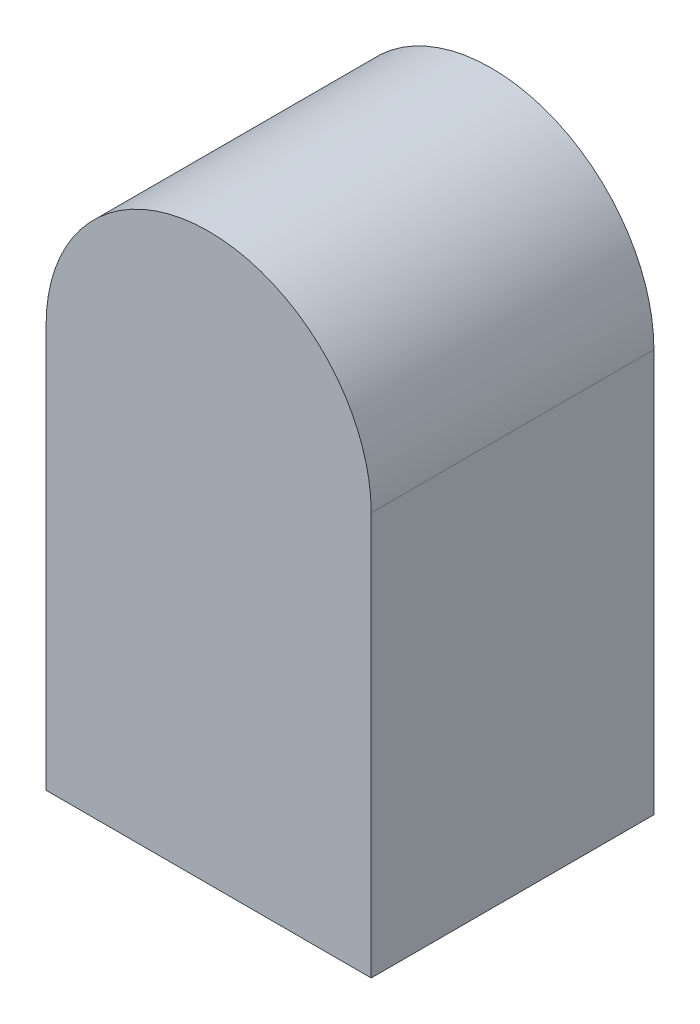
ISO-10303-21;
HEADER;
FILE_DESCRIPTION(('STEP AP214'),'2;1');
FILE_NAME('part.step','',(''),(''),'','','');
FILE_SCHEMA(('AUTOMOTIVE_DESIGN { 1 0 10303 214 1 1 1 1 }'));
ENDSEC;
DATA;
#1=APPLICATION_CONTEXT('core data for automotive mechanical design processes');
#2=APPLICATION_PROTOCOL_DEFINITION('international standard','automotive_design',2000,#1);
#3=PRODUCT_CONTEXT('',#1,'mechanical');
#4=PRODUCT('Part','Part','',(#3));
#5=PRODUCT_RELATED_PRODUCT_CATEGORY('part','',(#4));
#6=PRODUCT_DEFINITION_FORMATION('','',#4);
#7=PRODUCT_DEFINITION_CONTEXT('part definition',#1,'design');
#8=PRODUCT_DEFINITION('design','',#6,#7);
#9=PRODUCT_DEFINITION_SHAPE('','',#8);
#10=(LENGTH_UNIT() NAMED_UNIT(*) SI_UNIT(.MILLI.,.METRE.));
#11=(NAMED_UNIT(*) PLANE_ANGLE_UNIT() SI_UNIT($,.RADIAN.));
#12=(NAMED_UNIT(*) SI_UNIT($,.STERADIAN.) SOLID_ANGLE_UNIT());
#13=UNCERTAINTY_MEASURE_WITH_UNIT(LENGTH_MEASURE(1.E-05),#10,'distance_accuracy_value','');
#14=(GEOMETRIC_REPRESENTATION_CONTEXT(3) GLOBAL_UNCERTAINTY_ASSIGNED_CONTEXT((#13)) GLOBAL_UNIT_ASSIGNED_CONTEXT((#10,
#11,#12)) REPRESENTATION_CONTEXT('',''));
#15=CARTESIAN_POINT('',(0.,0.,0.));
#16=DIRECTION('',(0.,0.,1.));
#17=DIRECTION('',(1.,0.,0.));
#18=AXIS2_PLACEMENT_3D('',#15,#16,#17);
#19=CARTESIAN_POINT('',(2.25,-2.8335265642716,0.));
#20=DIRECTION('',(0.,0.,1.));
#21=DIRECTION('',(0.,1.,0.));
#22=AXIS2_PLACEMENT_3D('',#19,#20,#21);
#23=PLANE('',#22);
#24=DIRECTION('',(1.,0.,0.));
#25=VECTOR('',#24,1.);
#26=CARTESIAN_POINT('',(2.135,-3.,0.));
#27=LINE('',#26,#25);
#28=CARTESIAN_POINT('',(2.135,-3.,0.));
#29=VERTEX_POINT('',#28);
#30=CARTESIAN_POINT('',(2.365,-3.,0.));
#31=VERTEX_POINT('',#30);
#32=EDGE_CURVE('E11',#29,#31,#27,.T.);
#33=ORIENTED_EDGE('',*,*,#32,.F.);
#34=DIRECTION('',(0.,-1.,0.));
#35=VECTOR('',#34,1.);
#36=CARTESIAN_POINT('',(2.135,-2.715,0.));
#37=LINE('',#36,#35);
#38=CARTESIAN_POINT('',(2.135,-2.715,0.));
#39=VERTEX_POINT('',#38);
#40=EDGE_CURVE('E24',#39,#29,#37,.T.);
#41=ORIENTED_EDGE('',*,*,#40,.F.);
#42=CARTESIAN_POINT('',(2.25,-2.715,0.));
#43=DIRECTION('',(0.,0.,1.));
#44=DIRECTION('',(1.,0.,0.));
#45=AXIS2_PLACEMENT_3D('',#42,#43,#44);
#46=CIRCLE('',#45,0.115);
#47=CARTESIAN_POINT('',(2.365,-2.715,0.));
#48=VERTEX_POINT('',#47);
#49=EDGE_CURVE('E85',#48,#39,#46,.T.);
#50=ORIENTED_EDGE('',*,*,#49,.F.);
#51=DIRECTION('',(0.,1.,0.));
#52=VECTOR('',#51,1.);
#53=CARTESIAN_POINT('',(2.365,-3.,0.));
#54=LINE('',#53,#52);
#55=EDGE_CURVE('E82',#31,#48,#54,.T.);
#56=ORIENTED_EDGE('',*,*,#55,.F.);
#57=EDGE_LOOP('',(#33,#41,#50,#56));
#58=FACE_BOUND('',#57,.T.);
#59=ADVANCED_FACE('F17',(#58),#23,.F.);
#60=CARTESIAN_POINT('',(2.365,-3.,0.));
#61=DIRECTION('',(1.,0.,0.));
#62=DIRECTION('',(0.,1.,0.));
#63=AXIS2_PLACEMENT_3D('',#60,#61,#62);
#64=PLANE('',#63);
#65=ORIENTED_EDGE('',*,*,#55,.T.);
#66=DIRECTION('',(0.,0.,1.));
#67=VECTOR('',#66,1.);
#68=CARTESIAN_POINT('',(2.365,-2.715,0.));
#69=LINE('',#68,#67);
#70=CARTESIAN_POINT('',(2.365,-2.715,0.2));
#71=VERTEX_POINT('',#70);
#72=EDGE_CURVE('E80',#48,#71,#69,.T.);
#73=ORIENTED_EDGE('',*,*,#72,.T.);
#74=DIRECTION('',(0.,1.,0.));
#75=VECTOR('',#74,1.);
#76=CARTESIAN_POINT('',(2.365,-3.,0.2));
#77=LINE('',#76,#75);
#78=CARTESIAN_POINT('',(2.365,-3.,0.2));
#79=VERTEX_POINT('',#78);
#80=EDGE_CURVE('E78',#79,#71,#77,.T.);
#81=ORIENTED_EDGE('',*,*,#80,.F.);
#82=DIRECTION('',(0.,0.,-1.));
#83=VECTOR('',#82,1.);
#84=CARTESIAN_POINT('',(2.365,-3.,0.));
#85=LINE('',#84,#83);
#86=EDGE_CURVE('E71',#79,#31,#85,.T.);
#87=ORIENTED_EDGE('',*,*,#86,.T.);
#88=EDGE_LOOP('',(#65,#73,#81,#87));
#89=FACE_BOUND('',#88,.T.);
#90=ADVANCED_FACE('F91',(#89),#64,.T.);
#91=CARTESIAN_POINT('',(2.25,-2.715,0.));
#92=DIRECTION('',(0.,0.,1.));
#93=DIRECTION('',(1.,0.,0.));
#94=AXIS2_PLACEMENT_3D('',#91,#92,#93);
#95=CYLINDRICAL_SURFACE('',#94,0.115);
#96=ORIENTED_EDGE('',*,*,#49,.T.);
#97=DIRECTION('',(0.,0.,1.));
#98=VECTOR('',#97,1.);
#99=CARTESIAN_POINT('',(2.135,-2.715,0.));
#100=LINE('',#99,#98);
#101=CARTESIAN_POINT('',(2.135,-2.715,0.2));
#102=VERTEX_POINT('',#101);
#103=EDGE_CURVE('E75',#39,#102,#100,.T.);
#104=ORIENTED_EDGE('',*,*,#103,.T.);
#105=CARTESIAN_POINT('',(2.25,-2.715,0.2));
#106=DIRECTION('',(0.,0.,1.));
#107=DIRECTION('',(1.,0.,0.));
#108=AXIS2_PLACEMENT_3D('',#105,#106,#107);
#109=CIRCLE('',#108,0.115);
#110=EDGE_CURVE('E59',#71,#102,#109,.T.);
#111=ORIENTED_EDGE('',*,*,#110,.F.);
#112=ORIENTED_EDGE('',*,*,#72,.F.);
#113=EDGE_LOOP('',(#96,#104,#111,#112));
#114=FACE_BOUND('',#113,.T.);
#115=ADVANCED_FACE('F89',(#114),#95,.T.);
#116=CARTESIAN_POINT('',(2.135,-2.715,0.));
#117=DIRECTION('',(-1.,0.,0.));
#118=DIRECTION('',(0.,-1.,0.));
#119=AXIS2_PLACEMENT_3D('',#116,#117,#118);
#120=PLANE('',#119);
#121=ORIENTED_EDGE('',*,*,#40,.T.);
#122=DIRECTION('',(0.,0.,1.));
#123=VECTOR('',#122,1.);
#124=CARTESIAN_POINT('',(2.135,-3.,0.));
#125=LINE('',#124,#123);
#126=CARTESIAN_POINT('',(2.135,-3.,0.2));
#127=VERTEX_POINT('',#126);
#128=EDGE_CURVE('E53',#29,#127,#125,.T.);
#129=ORIENTED_EDGE('',*,*,#128,.T.);
#130=DIRECTION('',(0.,-1.,0.));
#131=VECTOR('',#130,1.);
#132=CARTESIAN_POINT('',(2.135,-2.715,0.2));
#133=LINE('',#132,#131);
#134=EDGE_CURVE('E57',#102,#127,#133,.T.);
#135=ORIENTED_EDGE('',*,*,#134,.F.);
#136=ORIENTED_EDGE('',*,*,#103,.F.);
#137=EDGE_LOOP('',(#121,#129,#135,#136));
#138=FACE_BOUND('',#137,.T.);
#139=ADVANCED_FACE('F55',(#138),#120,.T.);
#140=CARTESIAN_POINT('',(-3.,-3.,0.));
#141=DIRECTION('',(0.,-1.,0.));
#142=DIRECTION('',(1.,0.,0.));
#143=AXIS2_PLACEMENT_3D('',#140,#141,#142);
#144=PLANE('',#143);
#145=ORIENTED_EDGE('',*,*,#86,.F.);
#146=DIRECTION('',(1.,0.,0.));
#147=VECTOR('',#146,1.);
#148=CARTESIAN_POINT('',(-0.375,-3.,0.2));
#149=LINE('',#148,#147);
#150=EDGE_CURVE('E66',#127,#79,#149,.T.);
#151=ORIENTED_EDGE('',*,*,#150,.F.);
#152=ORIENTED_EDGE('',*,*,#128,.F.);
#153=ORIENTED_EDGE('',*,*,#32,.T.);
#154=EDGE_LOOP('',(#145,#151,#152,#153));
#155=FACE_BOUND('',#154,.T.);
#156=ADVANCED_FACE('F69',(#155),#144,.T.);
#157=CARTESIAN_POINT('',(2.25,-2.8335240809167,0.2));
#158=DIRECTION('',(0.,0.,1.));
#159=DIRECTION('',(1.,0.,0.));
#160=AXIS2_PLACEMENT_3D('',#157,#158,#159);
#161=PLANE('',#160);
#162=ORIENTED_EDGE('',*,*,#134,.T.);
#163=ORIENTED_EDGE('',*,*,#150,.T.);
#164=ORIENTED_EDGE('',*,*,#80,.T.);
#165=ORIENTED_EDGE('',*,*,#110,.T.);
#166=EDGE_LOOP('',(#162,#163,#164,#165));
#167=FACE_BOUND('',#166,.T.);
#168=ADVANCED_FACE('F64',(#167),#161,.T.);
#169=CLOSED_SHELL('',(#59,#90,#115,#139,#156,#168));
#170=MANIFOLD_SOLID_BREP('B1',#169);
#171=ADVANCED_BREP_SHAPE_REPRESENTATION('',(#18,#170),#14);
#172=SHAPE_DEFINITION_REPRESENTATION(#9,#171);
ENDSEC;
END-ISO-10303-21;
